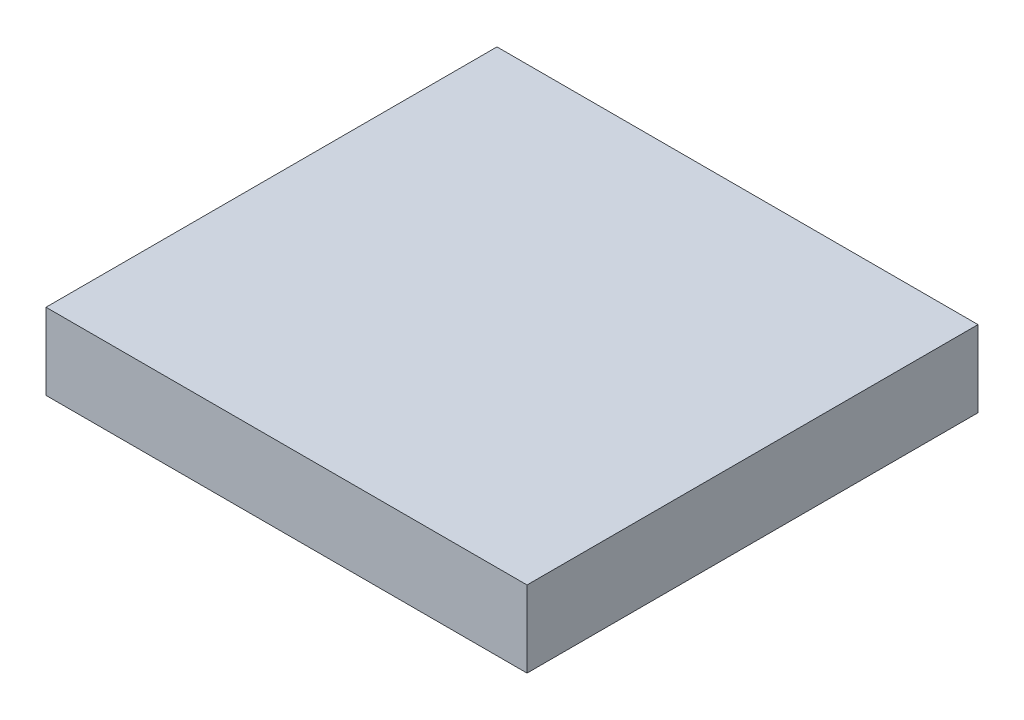
ISO-10303-21;
HEADER;
FILE_DESCRIPTION(('STEP AP214'),'2;1');
FILE_NAME('part.step','',(''),(''),'','','');
FILE_SCHEMA(('AUTOMOTIVE_DESIGN { 1 0 10303 214 1 1 1 1 }'));
ENDSEC;
DATA;
#1=APPLICATION_CONTEXT('core data for automotive mechanical design processes');
#2=APPLICATION_PROTOCOL_DEFINITION('international standard','automotive_design',2000,#1);
#3=PRODUCT_CONTEXT('',#1,'mechanical');
#4=PRODUCT('Part','Part','',(#3));
#5=PRODUCT_RELATED_PRODUCT_CATEGORY('part','',(#4));
#6=PRODUCT_DEFINITION_FORMATION('','',#4);
#7=PRODUCT_DEFINITION_CONTEXT('part definition',#1,'design');
#8=PRODUCT_DEFINITION('design','',#6,#7);
#9=PRODUCT_DEFINITION_SHAPE('','',#8);
#10=(LENGTH_UNIT() NAMED_UNIT(*) SI_UNIT(.MILLI.,.METRE.));
#11=(NAMED_UNIT(*) PLANE_ANGLE_UNIT() SI_UNIT($,.RADIAN.));
#12=(NAMED_UNIT(*) SI_UNIT($,.STERADIAN.) SOLID_ANGLE_UNIT());
#13=UNCERTAINTY_MEASURE_WITH_UNIT(LENGTH_MEASURE(1.E-05),#10,'distance_accuracy_value','');
#14=(GEOMETRIC_REPRESENTATION_CONTEXT(3) GLOBAL_UNCERTAINTY_ASSIGNED_CONTEXT((#13)) GLOBAL_UNIT_ASSIGNED_CONTEXT((#10,
#11,#12)) REPRESENTATION_CONTEXT('',''));
#15=CARTESIAN_POINT('',(0.,0.,0.));
#16=DIRECTION('',(0.,0.,1.));
#17=DIRECTION('',(1.,0.,0.));
#18=AXIS2_PLACEMENT_3D('',#15,#16,#17);
#19=CARTESIAN_POINT('',(0.,15.24,0.));
#20=DIRECTION('',(1.,0.,0.));
#21=DIRECTION('',(0.,0.,-1.));
#22=AXIS2_PLACEMENT_3D('',#19,#20,#21);
#23=PLANE('',#22);
#24=DIRECTION('',(0.,0.,1.));
#25=VECTOR('',#24,1.);
#26=CARTESIAN_POINT('',(0.,0.,0.));
#27=LINE('',#26,#25);
#28=CARTESIAN_POINT('',(0.,0.,-90.));
#29=VERTEX_POINT('',#28);
#30=CARTESIAN_POINT('',(0.,0.,0.));
#31=VERTEX_POINT('',#30);
#32=EDGE_CURVE('E106',#29,#31,#27,.T.);
#33=ORIENTED_EDGE('',*,*,#32,.T.);
#34=DIRECTION('',(0.,-1.,0.));
#35=VECTOR('',#34,1.);
#36=CARTESIAN_POINT('',(0.,15.24,0.));
#37=LINE('',#36,#35);
#38=CARTESIAN_POINT('',(0.,15.24,0.));
#39=VERTEX_POINT('',#38);
#40=EDGE_CURVE('E11',#39,#31,#37,.T.);
#41=ORIENTED_EDGE('',*,*,#40,.F.);
#42=DIRECTION('',(0.,0.,1.));
#43=VECTOR('',#42,1.);
#44=CARTESIAN_POINT('',(0.,15.24,0.));
#45=LINE('',#44,#43);
#46=CARTESIAN_POINT('',(0.,15.24,-90.));
#47=VERTEX_POINT('',#46);
#48=EDGE_CURVE('E94',#47,#39,#45,.T.);
#49=ORIENTED_EDGE('',*,*,#48,.F.);
#50=DIRECTION('',(0.,-1.,0.));
#51=VECTOR('',#50,1.);
#52=CARTESIAN_POINT('',(0.,15.24,-90.));
#53=LINE('',#52,#51);
#54=EDGE_CURVE('E102',#47,#29,#53,.T.);
#55=ORIENTED_EDGE('',*,*,#54,.T.);
#56=EDGE_LOOP('',(#33,#41,#49,#55));
#57=FACE_BOUND('',#56,.T.);
#58=ADVANCED_FACE('F43',(#57),#23,.F.);
#59=CARTESIAN_POINT('',(0.,15.24,0.));
#60=DIRECTION('',(0.,0.,-1.));
#61=DIRECTION('',(-1.,0.,0.));
#62=AXIS2_PLACEMENT_3D('',#59,#60,#61);
#63=PLANE('',#62);
#64=DIRECTION('',(1.,0.,0.));
#65=VECTOR('',#64,1.);
#66=CARTESIAN_POINT('',(0.,0.,0.));
#67=LINE('',#66,#65);
#68=CARTESIAN_POINT('',(96.,0.,0.));
#69=VERTEX_POINT('',#68);
#70=EDGE_CURVE('E98',#31,#69,#67,.T.);
#71=ORIENTED_EDGE('',*,*,#70,.T.);
#72=DIRECTION('',(0.,-1.,0.));
#73=VECTOR('',#72,1.);
#74=CARTESIAN_POINT('',(96.,15.24,0.));
#75=LINE('',#74,#73);
#76=CARTESIAN_POINT('',(96.,15.24,0.));
#77=VERTEX_POINT('',#76);
#78=EDGE_CURVE('E51',#77,#69,#75,.T.);
#79=ORIENTED_EDGE('',*,*,#78,.F.);
#80=DIRECTION('',(1.,0.,0.));
#81=VECTOR('',#80,1.);
#82=CARTESIAN_POINT('',(0.,15.24,0.));
#83=LINE('',#82,#81);
#84=EDGE_CURVE('E89',#39,#77,#83,.T.);
#85=ORIENTED_EDGE('',*,*,#84,.F.);
#86=ORIENTED_EDGE('',*,*,#40,.T.);
#87=EDGE_LOOP('',(#71,#79,#85,#86));
#88=FACE_BOUND('',#87,.T.);
#89=ADVANCED_FACE('F97',(#88),#63,.F.);
#90=CARTESIAN_POINT('',(96.,15.24,0.));
#91=DIRECTION('',(-1.,0.,0.));
#92=DIRECTION('',(0.,0.,1.));
#93=AXIS2_PLACEMENT_3D('',#90,#91,#92);
#94=PLANE('',#93);
#95=DIRECTION('',(0.,0.,-1.));
#96=VECTOR('',#95,1.);
#97=CARTESIAN_POINT('',(96.,0.,0.));
#98=LINE('',#97,#96);
#99=CARTESIAN_POINT('',(96.,0.,-90.));
#100=VERTEX_POINT('',#99);
#101=EDGE_CURVE('E76',#69,#100,#98,.T.);
#102=ORIENTED_EDGE('',*,*,#101,.T.);
#103=DIRECTION('',(0.,-1.,0.));
#104=VECTOR('',#103,1.);
#105=CARTESIAN_POINT('',(96.,15.24,-90.));
#106=LINE('',#105,#104);
#107=CARTESIAN_POINT('',(96.,15.24,-90.));
#108=VERTEX_POINT('',#107);
#109=EDGE_CURVE('E99',#108,#100,#106,.T.);
#110=ORIENTED_EDGE('',*,*,#109,.F.);
#111=DIRECTION('',(0.,0.,-1.));
#112=VECTOR('',#111,1.);
#113=CARTESIAN_POINT('',(96.,15.24,0.));
#114=LINE('',#113,#112);
#115=EDGE_CURVE('E92',#77,#108,#114,.T.);
#116=ORIENTED_EDGE('',*,*,#115,.F.);
#117=ORIENTED_EDGE('',*,*,#78,.T.);
#118=EDGE_LOOP('',(#102,#110,#116,#117));
#119=FACE_BOUND('',#118,.T.);
#120=ADVANCED_FACE('F100',(#119),#94,.F.);
#121=CARTESIAN_POINT('',(0.,15.24,-90.));
#122=DIRECTION('',(0.,0.,1.));
#123=DIRECTION('',(1.,0.,0.));
#124=AXIS2_PLACEMENT_3D('',#121,#122,#123);
#125=PLANE('',#124);
#126=DIRECTION('',(-1.,0.,0.));
#127=VECTOR('',#126,1.);
#128=CARTESIAN_POINT('',(0.,0.,-90.));
#129=LINE('',#128,#127);
#130=EDGE_CURVE('E82',#100,#29,#129,.T.);
#131=ORIENTED_EDGE('',*,*,#130,.T.);
#132=ORIENTED_EDGE('',*,*,#54,.F.);
#133=DIRECTION('',(-1.,0.,0.));
#134=VECTOR('',#133,1.);
#135=CARTESIAN_POINT('',(0.,15.24,-90.));
#136=LINE('',#135,#134);
#137=EDGE_CURVE('E59',#108,#47,#136,.T.);
#138=ORIENTED_EDGE('',*,*,#137,.F.);
#139=ORIENTED_EDGE('',*,*,#109,.T.);
#140=EDGE_LOOP('',(#131,#132,#138,#139));
#141=FACE_BOUND('',#140,.T.);
#142=ADVANCED_FACE('F113',(#141),#125,.F.);
#143=CARTESIAN_POINT('',(0.,15.24,0.));
#144=DIRECTION('',(0.,-1.,0.));
#145=DIRECTION('',(0.,0.,-1.));
#146=AXIS2_PLACEMENT_3D('',#143,#144,#145);
#147=PLANE('',#146);
#148=ORIENTED_EDGE('',*,*,#48,.T.);
#149=ORIENTED_EDGE('',*,*,#84,.T.);
#150=ORIENTED_EDGE('',*,*,#115,.T.);
#151=ORIENTED_EDGE('',*,*,#137,.T.);
#152=EDGE_LOOP('',(#148,#149,#150,#151));
#153=FACE_BOUND('',#152,.T.);
#154=ADVANCED_FACE('F90',(#153),#147,.F.);
#155=CARTESIAN_POINT('',(0.,0.,0.));
#156=DIRECTION('',(0.,-1.,0.));
#157=DIRECTION('',(0.,0.,-1.));
#158=AXIS2_PLACEMENT_3D('',#155,#156,#157);
#159=PLANE('',#158);
#160=ORIENTED_EDGE('',*,*,#32,.F.);
#161=ORIENTED_EDGE('',*,*,#130,.F.);
#162=ORIENTED_EDGE('',*,*,#101,.F.);
#163=ORIENTED_EDGE('',*,*,#70,.F.);
#164=EDGE_LOOP('',(#160,#161,#162,#163));
#165=FACE_BOUND('',#164,.T.);
#166=ADVANCED_FACE('F116',(#165),#159,.T.);
#167=CLOSED_SHELL('',(#58,#89,#120,#142,#154,#166));
#168=MANIFOLD_SOLID_BREP('B2',#167);
#169=ADVANCED_BREP_SHAPE_REPRESENTATION('',(#18,#168),#14);
#170=SHAPE_DEFINITION_REPRESENTATION(#9,#169);
ENDSEC;
END-ISO-10303-21;
